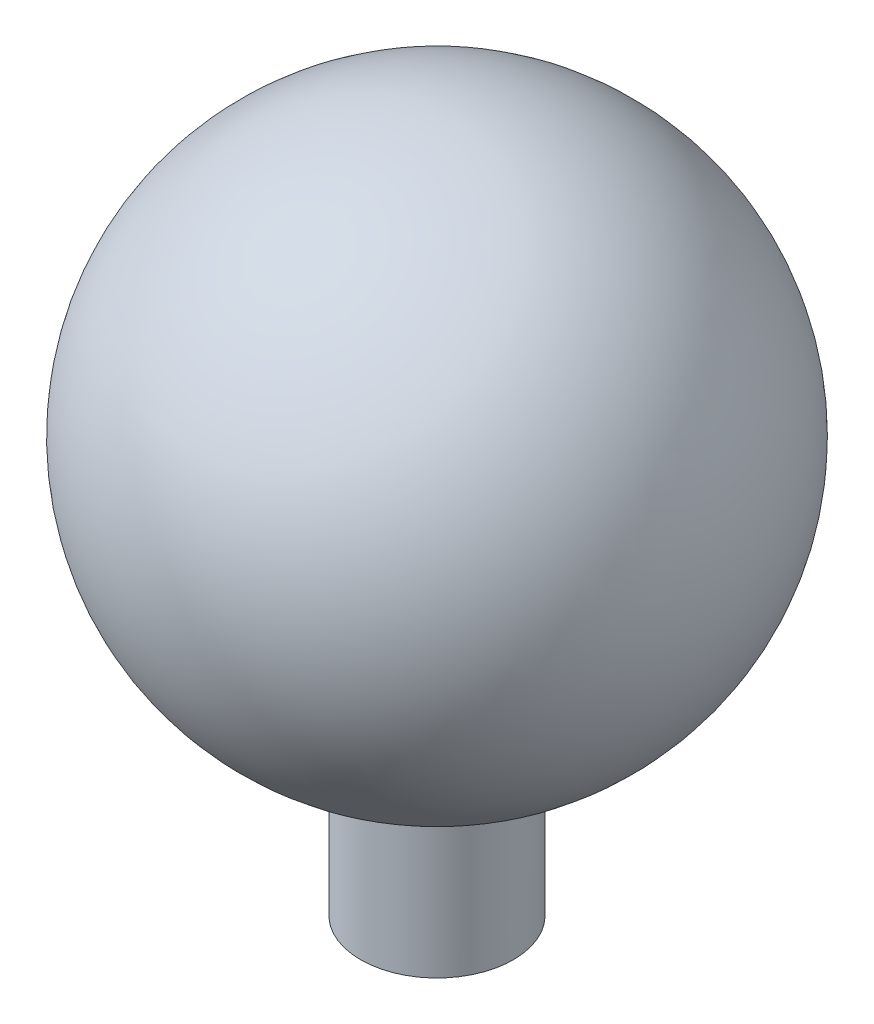
ISO-10303-21;
HEADER;
FILE_DESCRIPTION(('STEP AP214'),'2;1');
FILE_NAME('part.step','',(''),(''),'','','');
FILE_SCHEMA(('AUTOMOTIVE_DESIGN { 1 0 10303 214 1 1 1 1 }'));
ENDSEC;
DATA;
#1=APPLICATION_CONTEXT('core data for automotive mechanical design processes');
#2=APPLICATION_PROTOCOL_DEFINITION('international standard','automotive_design',2000,#1);
#3=PRODUCT_CONTEXT('',#1,'mechanical');
#4=PRODUCT('Part','Part','',(#3));
#5=PRODUCT_RELATED_PRODUCT_CATEGORY('part','',(#4));
#6=PRODUCT_DEFINITION_FORMATION('','',#4);
#7=PRODUCT_DEFINITION_CONTEXT('part definition',#1,'design');
#8=PRODUCT_DEFINITION('design','',#6,#7);
#9=PRODUCT_DEFINITION_SHAPE('','',#8);
#10=(LENGTH_UNIT() NAMED_UNIT(*) SI_UNIT(.MILLI.,.METRE.));
#11=(NAMED_UNIT(*) PLANE_ANGLE_UNIT() SI_UNIT($,.RADIAN.));
#12=(NAMED_UNIT(*) SI_UNIT($,.STERADIAN.) SOLID_ANGLE_UNIT());
#13=UNCERTAINTY_MEASURE_WITH_UNIT(LENGTH_MEASURE(1.E-05),#10,'distance_accuracy_value','');
#14=(GEOMETRIC_REPRESENTATION_CONTEXT(3) GLOBAL_UNCERTAINTY_ASSIGNED_CONTEXT((#13)) GLOBAL_UNIT_ASSIGNED_CONTEXT((#10,
#11,#12)) REPRESENTATION_CONTEXT('',''));
#15=CARTESIAN_POINT('',(0.,0.,0.));
#16=DIRECTION('',(0.,0.,1.));
#17=DIRECTION('',(1.,0.,0.));
#18=AXIS2_PLACEMENT_3D('',#15,#16,#17);
#19=CARTESIAN_POINT('',(0.,0.,0.));
#20=DIRECTION('',(0.,1.,0.));
#21=DIRECTION('',(1.,0.,0.));
#22=AXIS2_PLACEMENT_3D('',#19,#20,#21);
#23=SPHERICAL_SURFACE('',#22,79.5);
#24=CARTESIAN_POINT('',(0.,-76.3953532618313,0.));
#25=DIRECTION('',(0.,1.,0.));
#26=DIRECTION('',(0.,0.,1.));
#27=AXIS2_PLACEMENT_3D('',#24,#25,#26);
#28=CIRCLE('',#27,22.);
#29=CARTESIAN_POINT('',(0.,-76.3953532618313,22.));
#30=VERTEX_POINT('',#29);
#31=EDGE_CURVE('E10',#30,#30,#28,.T.);
#32=ORIENTED_EDGE('',*,*,#31,.T.);
#33=EDGE_LOOP('',(#32));
#34=FACE_BOUND('',#33,.T.);
#35=ADVANCED_FACE('F31',(#34),#23,.T.);
#36=CARTESIAN_POINT('',(0.,79.5,0.));
#37=DIRECTION('',(0.,1.,0.));
#38=DIRECTION('',(0.,0.,1.));
#39=AXIS2_PLACEMENT_3D('',#36,#37,#38);
#40=CYLINDRICAL_SURFACE('',#39,22.);
#41=ORIENTED_EDGE('',*,*,#31,.F.);
#42=EDGE_LOOP('',(#41));
#43=FACE_BOUND('',#42,.T.);
#44=CARTESIAN_POINT('',(0.,-119.5,0.));
#45=DIRECTION('',(0.,1.,0.));
#46=DIRECTION('',(0.,0.,1.));
#47=AXIS2_PLACEMENT_3D('',#44,#45,#46);
#48=CIRCLE('',#47,22.);
#49=CARTESIAN_POINT('',(0.,-119.5,22.));
#50=VERTEX_POINT('',#49);
#51=EDGE_CURVE('E37',#50,#50,#48,.T.);
#52=ORIENTED_EDGE('',*,*,#51,.T.);
#53=EDGE_LOOP('',(#52));
#54=FACE_BOUND('',#53,.T.);
#55=ADVANCED_FACE('F43',(#43,#54),#40,.T.);
#56=CARTESIAN_POINT('',(0.,-119.5,0.));
#57=DIRECTION('',(0.,1.,0.));
#58=DIRECTION('',(0.,0.,1.));
#59=AXIS2_PLACEMENT_3D('',#56,#57,#58);
#60=PLANE('',#59);
#61=ORIENTED_EDGE('',*,*,#51,.F.);
#62=EDGE_LOOP('',(#61));
#63=FACE_BOUND('',#62,.T.);
#64=ADVANCED_FACE('F45',(#63),#60,.F.);
#65=CLOSED_SHELL('',(#35,#55,#64));
#66=MANIFOLD_SOLID_BREP('B2',#65);
#67=ADVANCED_BREP_SHAPE_REPRESENTATION('',(#18,#66),#14);
#68=SHAPE_DEFINITION_REPRESENTATION(#9,#67);
ENDSEC;
END-ISO-10303-21;
